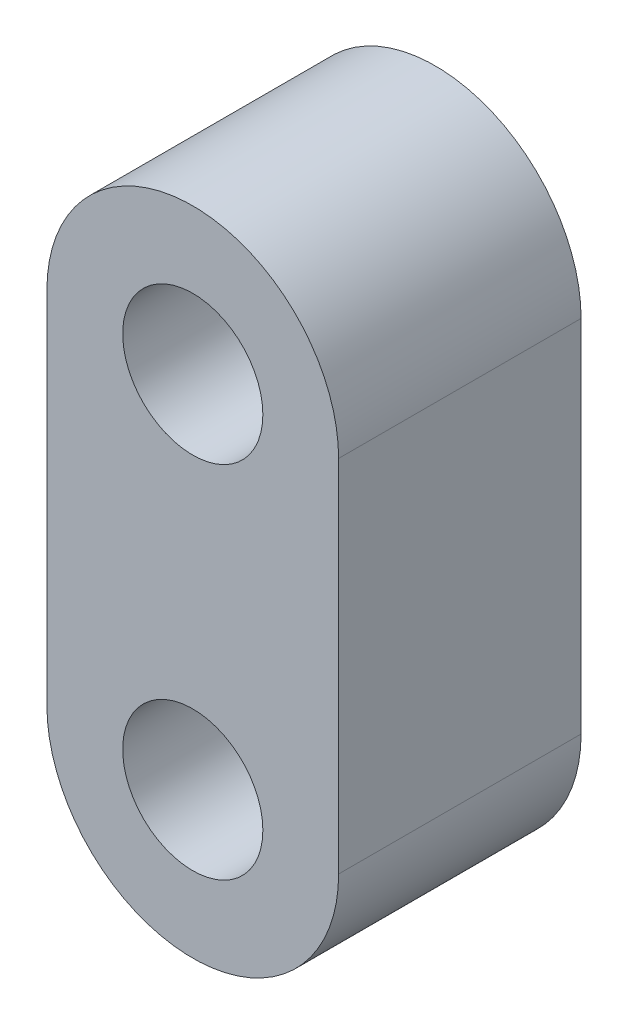
ISO-10303-21;
HEADER;
FILE_DESCRIPTION(('STEP AP214'),'2;1');
FILE_NAME('part.step','',(''),(''),'','','');
FILE_SCHEMA(('AUTOMOTIVE_DESIGN { 1 0 10303 214 1 1 1 1 }'));
ENDSEC;
DATA;
#1=APPLICATION_CONTEXT('core data for automotive mechanical design processes');
#2=APPLICATION_PROTOCOL_DEFINITION('international standard','automotive_design',2000,#1);
#3=PRODUCT_CONTEXT('',#1,'mechanical');
#4=PRODUCT('Part','Part','',(#3));
#5=PRODUCT_RELATED_PRODUCT_CATEGORY('part','',(#4));
#6=PRODUCT_DEFINITION_FORMATION('','',#4);
#7=PRODUCT_DEFINITION_CONTEXT('part definition',#1,'design');
#8=PRODUCT_DEFINITION('design','',#6,#7);
#9=PRODUCT_DEFINITION_SHAPE('','',#8);
#10=(LENGTH_UNIT() NAMED_UNIT(*) SI_UNIT(.MILLI.,.METRE.));
#11=(NAMED_UNIT(*) PLANE_ANGLE_UNIT() SI_UNIT($,.RADIAN.));
#12=(NAMED_UNIT(*) SI_UNIT($,.STERADIAN.) SOLID_ANGLE_UNIT());
#13=UNCERTAINTY_MEASURE_WITH_UNIT(LENGTH_MEASURE(1.E-05),#10,'distance_accuracy_value','');
#14=(GEOMETRIC_REPRESENTATION_CONTEXT(3) GLOBAL_UNCERTAINTY_ASSIGNED_CONTEXT((#13)) GLOBAL_UNIT_ASSIGNED_CONTEXT((#10,
#11,#12)) REPRESENTATION_CONTEXT('',''));
#15=CARTESIAN_POINT('',(0.,0.,0.));
#16=DIRECTION('',(0.,0.,1.));
#17=DIRECTION('',(1.,0.,0.));
#18=AXIS2_PLACEMENT_3D('',#15,#16,#17);
#19=CARTESIAN_POINT('',(0.,0.,6.4));
#20=DIRECTION('',(0.,0.,1.));
#21=DIRECTION('',(1.,0.,0.));
#22=AXIS2_PLACEMENT_3D('',#19,#20,#21);
#23=PLANE('',#22);
#24=CARTESIAN_POINT('',(0.,0.,6.4));
#25=DIRECTION('',(0.,0.,1.));
#26=DIRECTION('',(1.,0.,0.));
#27=AXIS2_PLACEMENT_3D('',#24,#25,#26);
#28=CIRCLE('',#27,1.85);
#29=CARTESIAN_POINT('',(1.85,0.,6.4));
#30=VERTEX_POINT('',#29);
#31=EDGE_CURVE('E99',#30,#30,#28,.T.);
#32=ORIENTED_EDGE('',*,*,#31,.F.);
#33=EDGE_LOOP('',(#32));
#34=FACE_BOUND('',#33,.T.);
#35=CARTESIAN_POINT('',(0.,0.,6.4));
#36=DIRECTION('',(0.,0.,1.));
#37=DIRECTION('',(1.,0.,0.));
#38=AXIS2_PLACEMENT_3D('',#35,#36,#37);
#39=CIRCLE('',#38,3.85);
#40=CARTESIAN_POINT('',(3.85,0.,6.4));
#41=VERTEX_POINT('',#40);
#42=CARTESIAN_POINT('',(-3.85,0.,6.4));
#43=VERTEX_POINT('',#42);
#44=EDGE_CURVE('E84',#41,#43,#39,.T.);
#45=ORIENTED_EDGE('',*,*,#44,.T.);
#46=DIRECTION('',(0.,-1.,0.));
#47=VECTOR('',#46,1.);
#48=CARTESIAN_POINT('',(-3.85,0.,6.4));
#49=LINE('',#48,#47);
#50=CARTESIAN_POINT('',(-3.85,-9.5,6.4));
#51=VERTEX_POINT('',#50);
#52=EDGE_CURVE('E79',#43,#51,#49,.T.);
#53=ORIENTED_EDGE('',*,*,#52,.T.);
#54=CARTESIAN_POINT('',(0.,-9.5,6.4));
#55=DIRECTION('',(0.,0.,1.));
#56=DIRECTION('',(1.,0.,0.));
#57=AXIS2_PLACEMENT_3D('',#54,#55,#56);
#58=CIRCLE('',#57,3.85);
#59=CARTESIAN_POINT('',(3.85,-9.5,6.4));
#60=VERTEX_POINT('',#59);
#61=EDGE_CURVE('E82',#51,#60,#58,.T.);
#62=ORIENTED_EDGE('',*,*,#61,.T.);
#63=DIRECTION('',(0.,1.,0.));
#64=VECTOR('',#63,1.);
#65=CARTESIAN_POINT('',(3.85,0.,6.4));
#66=LINE('',#65,#64);
#67=EDGE_CURVE('E49',#60,#41,#66,.T.);
#68=ORIENTED_EDGE('',*,*,#67,.T.);
#69=EDGE_LOOP('',(#45,#53,#62,#68));
#70=FACE_BOUND('',#69,.T.);
#71=CARTESIAN_POINT('',(0.,-9.5,6.4));
#72=DIRECTION('',(0.,0.,1.));
#73=DIRECTION('',(1.,0.,0.));
#74=AXIS2_PLACEMENT_3D('',#71,#72,#73);
#75=CIRCLE('',#74,1.85);
#76=CARTESIAN_POINT('',(1.85,-9.5,6.4));
#77=VERTEX_POINT('',#76);
#78=EDGE_CURVE('E114',#77,#77,#75,.T.);
#79=ORIENTED_EDGE('',*,*,#78,.F.);
#80=EDGE_LOOP('',(#79));
#81=FACE_BOUND('',#80,.T.);
#82=ADVANCED_FACE('F32',(#34,#70,#81),#23,.T.);
#83=CARTESIAN_POINT('',(0.,0.,0.));
#84=DIRECTION('',(0.,0.,1.));
#85=DIRECTION('',(1.,0.,0.));
#86=AXIS2_PLACEMENT_3D('',#83,#84,#85);
#87=PLANE('',#86);
#88=CARTESIAN_POINT('',(0.,0.,0.));
#89=DIRECTION('',(0.,0.,1.));
#90=DIRECTION('',(1.,0.,0.));
#91=AXIS2_PLACEMENT_3D('',#88,#89,#90);
#92=CIRCLE('',#91,1.85);
#93=CARTESIAN_POINT('',(1.85,0.,0.));
#94=VERTEX_POINT('',#93);
#95=EDGE_CURVE('E111',#94,#94,#92,.T.);
#96=ORIENTED_EDGE('',*,*,#95,.T.);
#97=EDGE_LOOP('',(#96));
#98=FACE_BOUND('',#97,.T.);
#99=CARTESIAN_POINT('',(0.,0.,0.));
#100=DIRECTION('',(0.,0.,1.));
#101=DIRECTION('',(1.,0.,0.));
#102=AXIS2_PLACEMENT_3D('',#99,#100,#101);
#103=CIRCLE('',#102,3.85);
#104=CARTESIAN_POINT('',(3.85,0.,0.));
#105=VERTEX_POINT('',#104);
#106=CARTESIAN_POINT('',(-3.85,0.,0.));
#107=VERTEX_POINT('',#106);
#108=EDGE_CURVE('E96',#105,#107,#103,.T.);
#109=ORIENTED_EDGE('',*,*,#108,.F.);
#110=DIRECTION('',(0.,1.,0.));
#111=VECTOR('',#110,1.);
#112=CARTESIAN_POINT('',(3.85,0.,0.));
#113=LINE('',#112,#111);
#114=CARTESIAN_POINT('',(3.85,-9.5,0.));
#115=VERTEX_POINT('',#114);
#116=EDGE_CURVE('E72',#115,#105,#113,.T.);
#117=ORIENTED_EDGE('',*,*,#116,.F.);
#118=CARTESIAN_POINT('',(0.,-9.5,0.));
#119=DIRECTION('',(0.,0.,1.));
#120=DIRECTION('',(1.,0.,0.));
#121=AXIS2_PLACEMENT_3D('',#118,#119,#120);
#122=CIRCLE('',#121,3.85);
#123=CARTESIAN_POINT('',(-3.85,-9.5,0.));
#124=VERTEX_POINT('',#123);
#125=EDGE_CURVE('E66',#124,#115,#122,.T.);
#126=ORIENTED_EDGE('',*,*,#125,.F.);
#127=DIRECTION('',(0.,-1.,0.));
#128=VECTOR('',#127,1.);
#129=CARTESIAN_POINT('',(-3.85,0.,0.));
#130=LINE('',#129,#128);
#131=EDGE_CURVE('E88',#107,#124,#130,.T.);
#132=ORIENTED_EDGE('',*,*,#131,.F.);
#133=EDGE_LOOP('',(#109,#117,#126,#132));
#134=FACE_BOUND('',#133,.T.);
#135=CARTESIAN_POINT('',(0.,-9.5,0.));
#136=DIRECTION('',(0.,0.,1.));
#137=DIRECTION('',(1.,0.,0.));
#138=AXIS2_PLACEMENT_3D('',#135,#136,#137);
#139=CIRCLE('',#138,1.85);
#140=CARTESIAN_POINT('',(1.85,-9.5,0.));
#141=VERTEX_POINT('',#140);
#142=EDGE_CURVE('E117',#141,#141,#139,.T.);
#143=ORIENTED_EDGE('',*,*,#142,.T.);
#144=EDGE_LOOP('',(#143));
#145=FACE_BOUND('',#144,.T.);
#146=ADVANCED_FACE('F107',(#98,#134,#145),#87,.F.);
#147=CARTESIAN_POINT('',(0.,0.,6.4));
#148=DIRECTION('',(0.,0.,-1.));
#149=DIRECTION('',(-1.,0.,0.));
#150=AXIS2_PLACEMENT_3D('',#147,#148,#149);
#151=CYLINDRICAL_SURFACE('',#150,3.85);
#152=ORIENTED_EDGE('',*,*,#108,.T.);
#153=DIRECTION('',(0.,0.,-1.));
#154=VECTOR('',#153,1.);
#155=CARTESIAN_POINT('',(-3.85,0.,6.4));
#156=LINE('',#155,#154);
#157=EDGE_CURVE('E11',#43,#107,#156,.T.);
#158=ORIENTED_EDGE('',*,*,#157,.F.);
#159=ORIENTED_EDGE('',*,*,#44,.F.);
#160=DIRECTION('',(0.,0.,-1.));
#161=VECTOR('',#160,1.);
#162=CARTESIAN_POINT('',(3.85,0.,6.4));
#163=LINE('',#162,#161);
#164=EDGE_CURVE('E92',#41,#105,#163,.T.);
#165=ORIENTED_EDGE('',*,*,#164,.T.);
#166=EDGE_LOOP('',(#152,#158,#159,#165));
#167=FACE_BOUND('',#166,.T.);
#168=ADVANCED_FACE('F34',(#167),#151,.T.);
#169=CARTESIAN_POINT('',(-3.85,0.,6.4));
#170=DIRECTION('',(1.,0.,0.));
#171=DIRECTION('',(0.,1.,0.));
#172=AXIS2_PLACEMENT_3D('',#169,#170,#171);
#173=PLANE('',#172);
#174=ORIENTED_EDGE('',*,*,#131,.T.);
#175=DIRECTION('',(0.,0.,-1.));
#176=VECTOR('',#175,1.);
#177=CARTESIAN_POINT('',(-3.85,-9.5,6.4));
#178=LINE('',#177,#176);
#179=EDGE_CURVE('E41',#51,#124,#178,.T.);
#180=ORIENTED_EDGE('',*,*,#179,.F.);
#181=ORIENTED_EDGE('',*,*,#52,.F.);
#182=ORIENTED_EDGE('',*,*,#157,.T.);
#183=EDGE_LOOP('',(#174,#180,#181,#182));
#184=FACE_BOUND('',#183,.T.);
#185=ADVANCED_FACE('F87',(#184),#173,.F.);
#186=CARTESIAN_POINT('',(0.,-9.5,6.4));
#187=DIRECTION('',(0.,0.,-1.));
#188=DIRECTION('',(-1.,0.,0.));
#189=AXIS2_PLACEMENT_3D('',#186,#187,#188);
#190=CYLINDRICAL_SURFACE('',#189,3.85);
#191=ORIENTED_EDGE('',*,*,#125,.T.);
#192=DIRECTION('',(0.,0.,-1.));
#193=VECTOR('',#192,1.);
#194=CARTESIAN_POINT('',(3.85,-9.5,6.4));
#195=LINE('',#194,#193);
#196=EDGE_CURVE('E89',#60,#115,#195,.T.);
#197=ORIENTED_EDGE('',*,*,#196,.F.);
#198=ORIENTED_EDGE('',*,*,#61,.F.);
#199=ORIENTED_EDGE('',*,*,#179,.T.);
#200=EDGE_LOOP('',(#191,#197,#198,#199));
#201=FACE_BOUND('',#200,.T.);
#202=ADVANCED_FACE('F90',(#201),#190,.T.);
#203=CARTESIAN_POINT('',(3.85,0.,6.4));
#204=DIRECTION('',(-1.,0.,0.));
#205=DIRECTION('',(0.,-1.,0.));
#206=AXIS2_PLACEMENT_3D('',#203,#204,#205);
#207=PLANE('',#206);
#208=ORIENTED_EDGE('',*,*,#116,.T.);
#209=ORIENTED_EDGE('',*,*,#164,.F.);
#210=ORIENTED_EDGE('',*,*,#67,.F.);
#211=ORIENTED_EDGE('',*,*,#196,.T.);
#212=EDGE_LOOP('',(#208,#209,#210,#211));
#213=FACE_BOUND('',#212,.T.);
#214=ADVANCED_FACE('F104',(#213),#207,.F.);
#215=CARTESIAN_POINT('',(0.,0.,6.4));
#216=DIRECTION('',(0.,0.,-1.));
#217=DIRECTION('',(-1.,0.,0.));
#218=AXIS2_PLACEMENT_3D('',#215,#216,#217);
#219=CYLINDRICAL_SURFACE('',#218,1.85);
#220=ORIENTED_EDGE('',*,*,#31,.T.);
#221=EDGE_LOOP('',(#220));
#222=FACE_BOUND('',#221,.T.);
#223=ORIENTED_EDGE('',*,*,#95,.F.);
#224=EDGE_LOOP('',(#223));
#225=FACE_BOUND('',#224,.T.);
#226=ADVANCED_FACE('F135',(#222,#225),#219,.F.);
#227=CARTESIAN_POINT('',(0.,-9.5,6.4));
#228=DIRECTION('',(0.,0.,-1.));
#229=DIRECTION('',(-1.,0.,0.));
#230=AXIS2_PLACEMENT_3D('',#227,#228,#229);
#231=CYLINDRICAL_SURFACE('',#230,1.85);
#232=ORIENTED_EDGE('',*,*,#78,.T.);
#233=EDGE_LOOP('',(#232));
#234=FACE_BOUND('',#233,.T.);
#235=ORIENTED_EDGE('',*,*,#142,.F.);
#236=EDGE_LOOP('',(#235));
#237=FACE_BOUND('',#236,.T.);
#238=ADVANCED_FACE('F123',(#234,#237),#231,.F.);
#239=CLOSED_SHELL('',(#82,#146,#168,#185,#202,#214,#226,#238));
#240=MANIFOLD_SOLID_BREP('B2',#239);
#241=ADVANCED_BREP_SHAPE_REPRESENTATION('',(#18,#240),#14);
#242=SHAPE_DEFINITION_REPRESENTATION(#9,#241);
ENDSEC;
END-ISO-10303-21;
